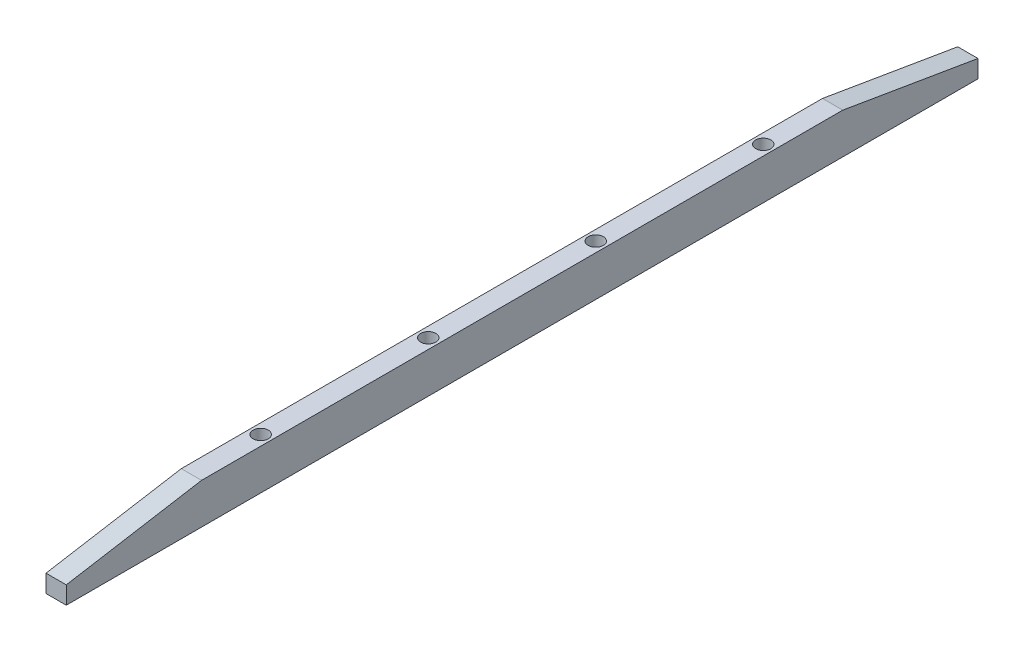
ISO-10303-21;
HEADER;
FILE_DESCRIPTION(('STEP AP214'),'2;1');
FILE_NAME('part.step','',(''),(''),'','','');
FILE_SCHEMA(('AUTOMOTIVE_DESIGN { 1 0 10303 214 1 1 1 1 }'));
ENDSEC;
DATA;
#1=APPLICATION_CONTEXT('core data for automotive mechanical design processes');
#2=APPLICATION_PROTOCOL_DEFINITION('international standard','automotive_design',2000,#1);
#3=PRODUCT_CONTEXT('',#1,'mechanical');
#4=PRODUCT('Part','Part','',(#3));
#5=PRODUCT_RELATED_PRODUCT_CATEGORY('part','',(#4));
#6=PRODUCT_DEFINITION_FORMATION('','',#4);
#7=PRODUCT_DEFINITION_CONTEXT('part definition',#1,'design');
#8=PRODUCT_DEFINITION('design','',#6,#7);
#9=PRODUCT_DEFINITION_SHAPE('','',#8);
#10=(LENGTH_UNIT() NAMED_UNIT(*) SI_UNIT(.MILLI.,.METRE.));
#11=(NAMED_UNIT(*) PLANE_ANGLE_UNIT() SI_UNIT($,.RADIAN.));
#12=(NAMED_UNIT(*) SI_UNIT($,.STERADIAN.) SOLID_ANGLE_UNIT());
#13=UNCERTAINTY_MEASURE_WITH_UNIT(LENGTH_MEASURE(1.E-05),#10,'distance_accuracy_value','');
#14=(GEOMETRIC_REPRESENTATION_CONTEXT(3) GLOBAL_UNCERTAINTY_ASSIGNED_CONTEXT((#13)) GLOBAL_UNIT_ASSIGNED_CONTEXT((#10,
#11,#12)) REPRESENTATION_CONTEXT('',''));
#15=CARTESIAN_POINT('',(0.,0.,0.));
#16=DIRECTION('',(0.,0.,1.));
#17=DIRECTION('',(1.,0.,0.));
#18=AXIS2_PLACEMENT_3D('',#15,#16,#17);
#19=CARTESIAN_POINT('',(6.35,0.,-248.465));
#20=DIRECTION('',(0.,1.,0.));
#21=DIRECTION('',(0.,0.,1.));
#22=AXIS2_PLACEMENT_3D('',#19,#20,#21);
#23=PLANE('',#22);
#24=CARTESIAN_POINT('',(3.175,0.,-184.343));
#25=DIRECTION('',(0.,-1.,0.));
#26=DIRECTION('',(0.,0.,-1.));
#27=AXIS2_PLACEMENT_3D('',#24,#25,#26);
#28=CIRCLE('',#27,2.38125);
#29=CARTESIAN_POINT('',(3.175,0.,-186.72425));
#30=VERTEX_POINT('',#29);
#31=EDGE_CURVE('E163',#30,#30,#28,.T.);
#32=ORIENTED_EDGE('',*,*,#31,.F.);
#33=EDGE_LOOP('',(#32));
#34=FACE_BOUND('',#33,.T.);
#35=CARTESIAN_POINT('',(3.175,0.,-131.843));
#36=DIRECTION('',(0.,-1.,0.));
#37=DIRECTION('',(0.,0.,-1.));
#38=AXIS2_PLACEMENT_3D('',#35,#36,#37);
#39=CIRCLE('',#38,2.38125);
#40=CARTESIAN_POINT('',(3.175,0.,-134.22425));
#41=VERTEX_POINT('',#40);
#42=EDGE_CURVE('E157',#41,#41,#39,.T.);
#43=ORIENTED_EDGE('',*,*,#42,.F.);
#44=EDGE_LOOP('',(#43));
#45=FACE_BOUND('',#44,.T.);
#46=CARTESIAN_POINT('',(3.175,0.,-79.343));
#47=DIRECTION('',(0.,-1.,0.));
#48=DIRECTION('',(0.,0.,-1.));
#49=AXIS2_PLACEMENT_3D('',#46,#47,#48);
#50=CIRCLE('',#49,2.38125);
#51=CARTESIAN_POINT('',(3.175,0.,-81.72425));
#52=VERTEX_POINT('',#51);
#53=EDGE_CURVE('E151',#52,#52,#50,.T.);
#54=ORIENTED_EDGE('',*,*,#53,.F.);
#55=EDGE_LOOP('',(#54));
#56=FACE_BOUND('',#55,.T.);
#57=CARTESIAN_POINT('',(3.175,0.,-26.843));
#58=DIRECTION('',(0.,-1.,0.));
#59=DIRECTION('',(0.,0.,-1.));
#60=AXIS2_PLACEMENT_3D('',#57,#58,#59);
#61=CIRCLE('',#60,2.38125);
#62=CARTESIAN_POINT('',(3.175,0.,-29.22425));
#63=VERTEX_POINT('',#62);
#64=EDGE_CURVE('E145',#63,#63,#61,.T.);
#65=ORIENTED_EDGE('',*,*,#64,.F.);
#66=EDGE_LOOP('',(#65));
#67=FACE_BOUND('',#66,.T.);
#68=DIRECTION('',(0.,0.,-1.));
#69=VECTOR('',#68,1.);
#70=CARTESIAN_POINT('',(0.,0.,-248.465));
#71=LINE('',#70,#69);
#72=CARTESIAN_POINT('',(0.,0.,37.279));
#73=VERTEX_POINT('',#72);
#74=CARTESIAN_POINT('',(0.,0.,-248.465));
#75=VERTEX_POINT('',#74);
#76=EDGE_CURVE('E79',#73,#75,#71,.T.);
#77=ORIENTED_EDGE('',*,*,#76,.T.);
#78=DIRECTION('',(-1.,0.,0.));
#79=VECTOR('',#78,1.);
#80=CARTESIAN_POINT('',(6.35,0.,-248.465));
#81=LINE('',#80,#79);
#82=CARTESIAN_POINT('',(6.35,0.,-248.465));
#83=VERTEX_POINT('',#82);
#84=EDGE_CURVE('E11',#83,#75,#81,.T.);
#85=ORIENTED_EDGE('',*,*,#84,.F.);
#86=DIRECTION('',(0.,0.,-1.));
#87=VECTOR('',#86,1.);
#88=CARTESIAN_POINT('',(6.35,0.,0.));
#89=LINE('',#88,#87);
#90=CARTESIAN_POINT('',(6.35,0.,37.279));
#91=VERTEX_POINT('',#90);
#92=EDGE_CURVE('E85',#91,#83,#89,.T.);
#93=ORIENTED_EDGE('',*,*,#92,.F.);
#94=DIRECTION('',(-1.,0.,0.));
#95=VECTOR('',#94,1.);
#96=CARTESIAN_POINT('',(6.35,0.,37.279));
#97=LINE('',#96,#95);
#98=EDGE_CURVE('E113',#91,#73,#97,.T.);
#99=ORIENTED_EDGE('',*,*,#98,.T.);
#100=EDGE_LOOP('',(#77,#85,#93,#99));
#101=FACE_BOUND('',#100,.T.);
#102=ADVANCED_FACE('F33',(#34,#45,#56,#67,#101),#23,.F.);
#103=CARTESIAN_POINT('',(6.35,5.53334848311948,-248.465));
#104=DIRECTION('',(0.,0.,1.));
#105=DIRECTION('',(1.,0.,0.));
#106=AXIS2_PLACEMENT_3D('',#103,#104,#105);
#107=PLANE('',#106);
#108=DIRECTION('',(0.,1.,0.));
#109=VECTOR('',#108,1.);
#110=CARTESIAN_POINT('',(0.,5.53334848311948,-248.465));
#111=LINE('',#110,#109);
#112=CARTESIAN_POINT('',(0.,5.53334848311948,-248.465));
#113=VERTEX_POINT('',#112);
#114=EDGE_CURVE('E118',#75,#113,#111,.T.);
#115=ORIENTED_EDGE('',*,*,#114,.T.);
#116=DIRECTION('',(-1.,0.,0.));
#117=VECTOR('',#116,1.);
#118=CARTESIAN_POINT('',(6.35,5.53334848311948,-248.465));
#119=LINE('',#118,#117);
#120=CARTESIAN_POINT('',(6.35,5.53334848311948,-248.465));
#121=VERTEX_POINT('',#120);
#122=EDGE_CURVE('E41',#121,#113,#119,.T.);
#123=ORIENTED_EDGE('',*,*,#122,.F.);
#124=DIRECTION('',(0.,1.,0.));
#125=VECTOR('',#124,1.);
#126=CARTESIAN_POINT('',(6.35,5.53334848311948,-248.465));
#127=LINE('',#126,#125);
#128=EDGE_CURVE('E141',#83,#121,#127,.T.);
#129=ORIENTED_EDGE('',*,*,#128,.F.);
#130=ORIENTED_EDGE('',*,*,#84,.T.);
#131=EDGE_LOOP('',(#115,#123,#129,#130));
#132=FACE_BOUND('',#131,.T.);
#133=ADVANCED_FACE('F180',(#132),#107,.F.);
#134=CARTESIAN_POINT('',(6.35,12.7,-206.069323583915));
#135=DIRECTION('',(0.,-0.986011484513905,0.166677390208406));
#136=DIRECTION('',(0.,-0.166677390208406,-0.986011484513905));
#137=AXIS2_PLACEMENT_3D('',#134,#135,#136);
#138=PLANE('',#137);
#139=DIRECTION('',(0.,0.166677390208406,0.986011484513905));
#140=VECTOR('',#139,1.);
#141=CARTESIAN_POINT('',(0.,12.7,-206.069323583915));
#142=LINE('',#141,#140);
#143=CARTESIAN_POINT('',(0.,12.7,-206.069323583915));
#144=VERTEX_POINT('',#143);
#145=EDGE_CURVE('E121',#113,#144,#142,.T.);
#146=ORIENTED_EDGE('',*,*,#145,.T.);
#147=DIRECTION('',(-1.,0.,0.));
#148=VECTOR('',#147,1.);
#149=CARTESIAN_POINT('',(6.35,12.7,-206.069323583915));
#150=LINE('',#149,#148);
#151=CARTESIAN_POINT('',(6.35,12.7,-206.069323583915));
#152=VERTEX_POINT('',#151);
#153=EDGE_CURVE('E108',#152,#144,#150,.T.);
#154=ORIENTED_EDGE('',*,*,#153,.F.);
#155=DIRECTION('',(0.,0.166677390208406,0.986011484513905));
#156=VECTOR('',#155,1.);
#157=CARTESIAN_POINT('',(6.35,12.7,-206.069323583915));
#158=LINE('',#157,#156);
#159=EDGE_CURVE('E99',#121,#152,#158,.T.);
#160=ORIENTED_EDGE('',*,*,#159,.F.);
#161=ORIENTED_EDGE('',*,*,#122,.T.);
#162=EDGE_LOOP('',(#146,#154,#160,#161));
#163=FACE_BOUND('',#162,.T.);
#164=ADVANCED_FACE('F134',(#163),#138,.F.);
#165=CARTESIAN_POINT('',(6.35,12.7,-5.1166764160854));
#166=DIRECTION('',(0.,-1.,0.));
#167=DIRECTION('',(0.,0.,-1.));
#168=AXIS2_PLACEMENT_3D('',#165,#166,#167);
#169=PLANE('',#168);
#170=CARTESIAN_POINT('',(3.175,12.7,-184.343));
#171=DIRECTION('',(0.,-1.,0.));
#172=DIRECTION('',(0.,0.,-1.));
#173=AXIS2_PLACEMENT_3D('',#170,#171,#172);
#174=CIRCLE('',#173,2.38125);
#175=CARTESIAN_POINT('',(3.175,12.7,-186.72425));
#176=VERTEX_POINT('',#175);
#177=EDGE_CURVE('E160',#176,#176,#174,.T.);
#178=ORIENTED_EDGE('',*,*,#177,.T.);
#179=EDGE_LOOP('',(#178));
#180=FACE_BOUND('',#179,.T.);
#181=CARTESIAN_POINT('',(3.175,12.7,-131.843));
#182=DIRECTION('',(0.,-1.,0.));
#183=DIRECTION('',(0.,0.,-1.));
#184=AXIS2_PLACEMENT_3D('',#181,#182,#183);
#185=CIRCLE('',#184,2.38125);
#186=CARTESIAN_POINT('',(3.175,12.7,-134.22425));
#187=VERTEX_POINT('',#186);
#188=EDGE_CURVE('E154',#187,#187,#185,.T.);
#189=ORIENTED_EDGE('',*,*,#188,.T.);
#190=EDGE_LOOP('',(#189));
#191=FACE_BOUND('',#190,.T.);
#192=CARTESIAN_POINT('',(3.175,12.7,-79.343));
#193=DIRECTION('',(0.,-1.,0.));
#194=DIRECTION('',(0.,0.,-1.));
#195=AXIS2_PLACEMENT_3D('',#192,#193,#194);
#196=CIRCLE('',#195,2.38125);
#197=CARTESIAN_POINT('',(3.175,12.7,-81.72425));
#198=VERTEX_POINT('',#197);
#199=EDGE_CURVE('E148',#198,#198,#196,.T.);
#200=ORIENTED_EDGE('',*,*,#199,.T.);
#201=EDGE_LOOP('',(#200));
#202=FACE_BOUND('',#201,.T.);
#203=CARTESIAN_POINT('',(3.175,12.7,-26.843));
#204=DIRECTION('',(0.,-1.,0.));
#205=DIRECTION('',(0.,0.,-1.));
#206=AXIS2_PLACEMENT_3D('',#203,#204,#205);
#207=CIRCLE('',#206,2.38125);
#208=CARTESIAN_POINT('',(3.175,12.7,-29.22425));
#209=VERTEX_POINT('',#208);
#210=EDGE_CURVE('E119',#209,#209,#207,.T.);
#211=ORIENTED_EDGE('',*,*,#210,.T.);
#212=EDGE_LOOP('',(#211));
#213=FACE_BOUND('',#212,.T.);
#214=DIRECTION('',(0.,0.,1.));
#215=VECTOR('',#214,1.);
#216=CARTESIAN_POINT('',(0.,12.7,-5.1166764160854));
#217=LINE('',#216,#215);
#218=CARTESIAN_POINT('',(0.,12.7,-5.1166764160854));
#219=VERTEX_POINT('',#218);
#220=EDGE_CURVE('E107',#144,#219,#217,.T.);
#221=ORIENTED_EDGE('',*,*,#220,.T.);
#222=DIRECTION('',(-1.,0.,0.));
#223=VECTOR('',#222,1.);
#224=CARTESIAN_POINT('',(6.35,12.7,-5.1166764160854));
#225=LINE('',#224,#223);
#226=CARTESIAN_POINT('',(6.35,12.7,-5.1166764160854));
#227=VERTEX_POINT('',#226);
#228=EDGE_CURVE('E104',#227,#219,#225,.T.);
#229=ORIENTED_EDGE('',*,*,#228,.F.);
#230=DIRECTION('',(0.,0.,1.));
#231=VECTOR('',#230,1.);
#232=CARTESIAN_POINT('',(6.35,12.7,-5.1166764160854));
#233=LINE('',#232,#231);
#234=EDGE_CURVE('E93',#152,#227,#233,.T.);
#235=ORIENTED_EDGE('',*,*,#234,.F.);
#236=ORIENTED_EDGE('',*,*,#153,.T.);
#237=EDGE_LOOP('',(#221,#229,#235,#236));
#238=FACE_BOUND('',#237,.T.);
#239=ADVANCED_FACE('F105',(#180,#191,#202,#213,#238),#169,.F.);
#240=CARTESIAN_POINT('',(6.35,5.53334848311948,37.279));
#241=DIRECTION('',(0.,-0.986011484513905,-0.166677390208406));
#242=DIRECTION('',(0.,0.166677390208406,-0.986011484513905));
#243=AXIS2_PLACEMENT_3D('',#240,#241,#242);
#244=PLANE('',#243);
#245=DIRECTION('',(0.,-0.166677390208406,0.986011484513905));
#246=VECTOR('',#245,1.);
#247=CARTESIAN_POINT('',(0.,5.53334848311948,37.279));
#248=LINE('',#247,#246);
#249=CARTESIAN_POINT('',(0.,5.53334848311948,37.279));
#250=VERTEX_POINT('',#249);
#251=EDGE_CURVE('E72',#219,#250,#248,.T.);
#252=ORIENTED_EDGE('',*,*,#251,.T.);
#253=DIRECTION('',(-1.,0.,0.));
#254=VECTOR('',#253,1.);
#255=CARTESIAN_POINT('',(6.35,5.53334848311948,37.279));
#256=LINE('',#255,#254);
#257=CARTESIAN_POINT('',(6.35,5.53334848311948,37.279));
#258=VERTEX_POINT('',#257);
#259=EDGE_CURVE('E109',#258,#250,#256,.T.);
#260=ORIENTED_EDGE('',*,*,#259,.F.);
#261=DIRECTION('',(0.,-0.166677390208406,0.986011484513905));
#262=VECTOR('',#261,1.);
#263=CARTESIAN_POINT('',(6.35,5.53334848311948,37.279));
#264=LINE('',#263,#262);
#265=EDGE_CURVE('E97',#227,#258,#264,.T.);
#266=ORIENTED_EDGE('',*,*,#265,.F.);
#267=ORIENTED_EDGE('',*,*,#228,.T.);
#268=EDGE_LOOP('',(#252,#260,#266,#267));
#269=FACE_BOUND('',#268,.T.);
#270=ADVANCED_FACE('F111',(#269),#244,.F.);
#271=CARTESIAN_POINT('',(6.35,0.,37.279));
#272=DIRECTION('',(0.,0.,-1.));
#273=DIRECTION('',(-1.,0.,0.));
#274=AXIS2_PLACEMENT_3D('',#271,#272,#273);
#275=PLANE('',#274);
#276=DIRECTION('',(0.,-1.,0.));
#277=VECTOR('',#276,1.);
#278=CARTESIAN_POINT('',(0.,0.,37.279));
#279=LINE('',#278,#277);
#280=EDGE_CURVE('E125',#250,#73,#279,.T.);
#281=ORIENTED_EDGE('',*,*,#280,.T.);
#282=ORIENTED_EDGE('',*,*,#98,.F.);
#283=DIRECTION('',(0.,-1.,0.));
#284=VECTOR('',#283,1.);
#285=CARTESIAN_POINT('',(6.35,0.,37.279));
#286=LINE('',#285,#284);
#287=EDGE_CURVE('E49',#258,#91,#286,.T.);
#288=ORIENTED_EDGE('',*,*,#287,.F.);
#289=ORIENTED_EDGE('',*,*,#259,.T.);
#290=EDGE_LOOP('',(#281,#282,#288,#289));
#291=FACE_BOUND('',#290,.T.);
#292=ADVANCED_FACE('F139',(#291),#275,.F.);
#293=CARTESIAN_POINT('',(6.35,0.,0.));
#294=DIRECTION('',(-1.,0.,0.));
#295=DIRECTION('',(0.,0.,1.));
#296=AXIS2_PLACEMENT_3D('',#293,#294,#295);
#297=PLANE('',#296);
#298=ORIENTED_EDGE('',*,*,#92,.T.);
#299=ORIENTED_EDGE('',*,*,#128,.T.);
#300=ORIENTED_EDGE('',*,*,#159,.T.);
#301=ORIENTED_EDGE('',*,*,#234,.T.);
#302=ORIENTED_EDGE('',*,*,#265,.T.);
#303=ORIENTED_EDGE('',*,*,#287,.T.);
#304=EDGE_LOOP('',(#298,#299,#300,#301,#302,#303));
#305=FACE_BOUND('',#304,.T.);
#306=ADVANCED_FACE('F95',(#305),#297,.F.);
#307=CARTESIAN_POINT('',(0.,0.,0.));
#308=DIRECTION('',(-1.,0.,0.));
#309=DIRECTION('',(0.,0.,1.));
#310=AXIS2_PLACEMENT_3D('',#307,#308,#309);
#311=PLANE('',#310);
#312=ORIENTED_EDGE('',*,*,#76,.F.);
#313=ORIENTED_EDGE('',*,*,#280,.F.);
#314=ORIENTED_EDGE('',*,*,#251,.F.);
#315=ORIENTED_EDGE('',*,*,#220,.F.);
#316=ORIENTED_EDGE('',*,*,#145,.F.);
#317=ORIENTED_EDGE('',*,*,#114,.F.);
#318=EDGE_LOOP('',(#312,#313,#314,#315,#316,#317));
#319=FACE_BOUND('',#318,.T.);
#320=ADVANCED_FACE('F137',(#319),#311,.T.);
#321=CARTESIAN_POINT('',(3.175,12.7,-26.843));
#322=DIRECTION('',(0.,-1.,0.));
#323=DIRECTION('',(0.,0.,-1.));
#324=AXIS2_PLACEMENT_3D('',#321,#322,#323);
#325=CYLINDRICAL_SURFACE('',#324,2.38125);
#326=ORIENTED_EDGE('',*,*,#210,.F.);
#327=EDGE_LOOP('',(#326));
#328=FACE_BOUND('',#327,.T.);
#329=ORIENTED_EDGE('',*,*,#64,.T.);
#330=EDGE_LOOP('',(#329));
#331=FACE_BOUND('',#330,.T.);
#332=ADVANCED_FACE('F187',(#328,#331),#325,.F.);
#333=CARTESIAN_POINT('',(3.175,12.7,-79.343));
#334=DIRECTION('',(0.,-1.,0.));
#335=DIRECTION('',(0.,0.,-1.));
#336=AXIS2_PLACEMENT_3D('',#333,#334,#335);
#337=CYLINDRICAL_SURFACE('',#336,2.38125);
#338=ORIENTED_EDGE('',*,*,#199,.F.);
#339=EDGE_LOOP('',(#338));
#340=FACE_BOUND('',#339,.T.);
#341=ORIENTED_EDGE('',*,*,#53,.T.);
#342=EDGE_LOOP('',(#341));
#343=FACE_BOUND('',#342,.T.);
#344=ADVANCED_FACE('F189',(#340,#343),#337,.F.);
#345=CARTESIAN_POINT('',(3.175,12.7,-131.843));
#346=DIRECTION('',(0.,-1.,0.));
#347=DIRECTION('',(0.,0.,-1.));
#348=AXIS2_PLACEMENT_3D('',#345,#346,#347);
#349=CYLINDRICAL_SURFACE('',#348,2.38125);
#350=ORIENTED_EDGE('',*,*,#188,.F.);
#351=EDGE_LOOP('',(#350));
#352=FACE_BOUND('',#351,.T.);
#353=ORIENTED_EDGE('',*,*,#42,.T.);
#354=EDGE_LOOP('',(#353));
#355=FACE_BOUND('',#354,.T.);
#356=ADVANCED_FACE('F174',(#352,#355),#349,.F.);
#357=CARTESIAN_POINT('',(3.175,12.7,-184.343));
#358=DIRECTION('',(0.,-1.,0.));
#359=DIRECTION('',(0.,0.,-1.));
#360=AXIS2_PLACEMENT_3D('',#357,#358,#359);
#361=CYLINDRICAL_SURFACE('',#360,2.38125);
#362=ORIENTED_EDGE('',*,*,#177,.F.);
#363=EDGE_LOOP('',(#362));
#364=FACE_BOUND('',#363,.T.);
#365=ORIENTED_EDGE('',*,*,#31,.T.);
#366=EDGE_LOOP('',(#365));
#367=FACE_BOUND('',#366,.T.);
#368=ADVANCED_FACE('F171',(#364,#367),#361,.F.);
#369=CLOSED_SHELL('',(#102,#133,#164,#239,#270,#292,#306,#320,#332,#344,#356,#368));
#370=MANIFOLD_SOLID_BREP('B2',#369);
#371=ADVANCED_BREP_SHAPE_REPRESENTATION('',(#18,#370),#14);
#372=SHAPE_DEFINITION_REPRESENTATION(#9,#371);
ENDSEC;
END-ISO-10303-21;
